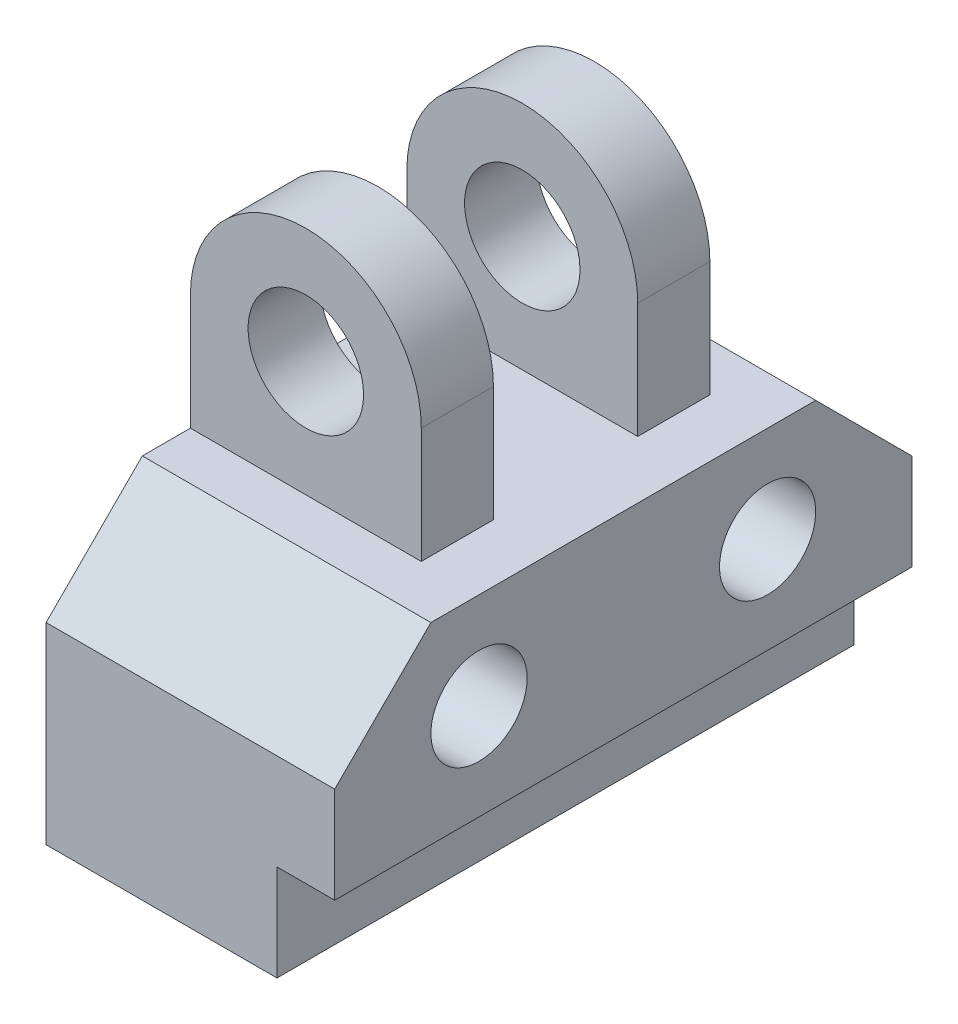
ISO-10303-21;
HEADER;
FILE_DESCRIPTION(('STEP AP214'),'2;1');
FILE_NAME('part.step','',(''),(''),'','','');
FILE_SCHEMA(('AUTOMOTIVE_DESIGN { 1 0 10303 214 1 1 1 1 }'));
ENDSEC;
DATA;
#1=APPLICATION_CONTEXT('core data for automotive mechanical design processes');
#2=APPLICATION_PROTOCOL_DEFINITION('international standard','automotive_design',2000,#1);
#3=PRODUCT_CONTEXT('',#1,'mechanical');
#4=PRODUCT('Part','Part','',(#3));
#5=PRODUCT_RELATED_PRODUCT_CATEGORY('part','',(#4));
#6=PRODUCT_DEFINITION_FORMATION('','',#4);
#7=PRODUCT_DEFINITION_CONTEXT('part definition',#1,'design');
#8=PRODUCT_DEFINITION('design','',#6,#7);
#9=PRODUCT_DEFINITION_SHAPE('','',#8);
#10=(LENGTH_UNIT() NAMED_UNIT(*) SI_UNIT(.MILLI.,.METRE.));
#11=(NAMED_UNIT(*) PLANE_ANGLE_UNIT() SI_UNIT($,.RADIAN.));
#12=(NAMED_UNIT(*) SI_UNIT($,.STERADIAN.) SOLID_ANGLE_UNIT());
#13=UNCERTAINTY_MEASURE_WITH_UNIT(LENGTH_MEASURE(1.E-05),#10,'distance_accuracy_value','');
#14=(GEOMETRIC_REPRESENTATION_CONTEXT(3) GLOBAL_UNCERTAINTY_ASSIGNED_CONTEXT((#13)) GLOBAL_UNIT_ASSIGNED_CONTEXT((#10,
#11,#12)) REPRESENTATION_CONTEXT('',''));
#15=CARTESIAN_POINT('',(0.,0.,0.));
#16=DIRECTION('',(0.,0.,1.));
#17=DIRECTION('',(1.,0.,0.));
#18=AXIS2_PLACEMENT_3D('',#15,#16,#17);
#19=CARTESIAN_POINT('',(12.,27.,-15.));
#20=DIRECTION('',(0.,0.,1.));
#21=DIRECTION('',(1.,0.,0.));
#22=AXIS2_PLACEMENT_3D('',#19,#20,#21);
#23=CYLINDRICAL_SURFACE('',#22,12.);
#24=DIRECTION('',(0.,0.,1.));
#25=VECTOR('',#24,1.);
#26=CARTESIAN_POINT('',(24.,27.,-7.5));
#27=LINE('',#26,#25);
#28=CARTESIAN_POINT('',(24.,27.,-15.));
#29=VERTEX_POINT('',#28);
#30=CARTESIAN_POINT('',(24.,27.,-7.5));
#31=VERTEX_POINT('',#30);
#32=EDGE_CURVE('E284',#29,#31,#27,.T.);
#33=ORIENTED_EDGE('',*,*,#32,.F.);
#34=CARTESIAN_POINT('',(12.,27.,-15.));
#35=DIRECTION('',(0.,0.,-1.));
#36=DIRECTION('',(-1.,0.,0.));
#37=AXIS2_PLACEMENT_3D('',#34,#35,#36);
#38=CIRCLE('',#37,12.);
#39=CARTESIAN_POINT('',(0.,27.,-15.));
#40=VERTEX_POINT('',#39);
#41=EDGE_CURVE('E43',#40,#29,#38,.T.);
#42=ORIENTED_EDGE('',*,*,#41,.F.);
#43=DIRECTION('',(0.,0.,-1.));
#44=VECTOR('',#43,1.);
#45=CARTESIAN_POINT('',(0.,27.,-15.));
#46=LINE('',#45,#44);
#47=CARTESIAN_POINT('',(0.,27.,-7.5));
#48=VERTEX_POINT('',#47);
#49=EDGE_CURVE('E289',#48,#40,#46,.T.);
#50=ORIENTED_EDGE('',*,*,#49,.F.);
#51=CARTESIAN_POINT('',(12.,27.,-7.5));
#52=DIRECTION('',(0.,0.,1.));
#53=DIRECTION('',(1.,0.,0.));
#54=AXIS2_PLACEMENT_3D('',#51,#52,#53);
#55=CIRCLE('',#54,12.);
#56=EDGE_CURVE('E11',#31,#48,#55,.T.);
#57=ORIENTED_EDGE('',*,*,#56,.F.);
#58=EDGE_LOOP('',(#33,#42,#50,#57));
#59=FACE_BOUND('',#58,.T.);
#60=ADVANCED_FACE('F35',(#59),#23,.T.);
#61=CARTESIAN_POINT('',(12.,27.,7.5));
#62=DIRECTION('',(0.,0.,-1.));
#63=DIRECTION('',(-1.,0.,0.));
#64=AXIS2_PLACEMENT_3D('',#61,#62,#63);
#65=CYLINDRICAL_SURFACE('',#64,12.);
#66=DIRECTION('',(0.,0.,1.));
#67=VECTOR('',#66,1.);
#68=CARTESIAN_POINT('',(24.,27.,7.5));
#69=LINE('',#68,#67);
#70=CARTESIAN_POINT('',(24.,27.,7.5));
#71=VERTEX_POINT('',#70);
#72=CARTESIAN_POINT('',(24.,27.,15.));
#73=VERTEX_POINT('',#72);
#74=EDGE_CURVE('E275',#71,#73,#69,.T.);
#75=ORIENTED_EDGE('',*,*,#74,.F.);
#76=CARTESIAN_POINT('',(12.,27.,7.5));
#77=DIRECTION('',(0.,0.,1.));
#78=DIRECTION('',(1.,0.,0.));
#79=AXIS2_PLACEMENT_3D('',#76,#77,#78);
#80=CIRCLE('',#79,12.);
#81=CARTESIAN_POINT('',(0.,27.,7.5));
#82=VERTEX_POINT('',#81);
#83=EDGE_CURVE('E280',#82,#71,#80,.F.);
#84=ORIENTED_EDGE('',*,*,#83,.F.);
#85=DIRECTION('',(0.,0.,1.));
#86=VECTOR('',#85,1.);
#87=CARTESIAN_POINT('',(0.,27.,7.5));
#88=LINE('',#87,#86);
#89=CARTESIAN_POINT('',(0.,27.,15.));
#90=VERTEX_POINT('',#89);
#91=EDGE_CURVE('E278',#90,#82,#88,.F.);
#92=ORIENTED_EDGE('',*,*,#91,.F.);
#93=CARTESIAN_POINT('',(12.,27.,15.));
#94=DIRECTION('',(0.,0.,-1.));
#95=DIRECTION('',(-1.,0.,0.));
#96=AXIS2_PLACEMENT_3D('',#93,#94,#95);
#97=CIRCLE('',#96,12.);
#98=EDGE_CURVE('E282',#73,#90,#97,.F.);
#99=ORIENTED_EDGE('',*,*,#98,.F.);
#100=EDGE_LOOP('',(#75,#84,#92,#99));
#101=FACE_BOUND('',#100,.T.);
#102=ADVANCED_FACE('F310',(#101),#65,.T.);
#103=CARTESIAN_POINT('',(30.,15.,20.));
#104=DIRECTION('',(0.,-1.,0.));
#105=DIRECTION('',(0.,0.,-1.));
#106=AXIS2_PLACEMENT_3D('',#103,#104,#105);
#107=PLANE('',#106);
#108=DIRECTION('',(0.,0.,1.));
#109=VECTOR('',#108,1.);
#110=CARTESIAN_POINT('',(24.,15.,-7.5));
#111=LINE('',#110,#109);
#112=CARTESIAN_POINT('',(24.,15.,-15.));
#113=VERTEX_POINT('',#112);
#114=CARTESIAN_POINT('',(24.,15.,-7.5));
#115=VERTEX_POINT('',#114);
#116=EDGE_CURVE('E170',#113,#115,#111,.T.);
#117=ORIENTED_EDGE('',*,*,#116,.T.);
#118=DIRECTION('',(-1.,0.,0.));
#119=VECTOR('',#118,1.);
#120=CARTESIAN_POINT('',(0.,15.,-7.5));
#121=LINE('',#120,#119);
#122=CARTESIAN_POINT('',(0.,15.,-7.5));
#123=VERTEX_POINT('',#122);
#124=EDGE_CURVE('E148',#115,#123,#121,.T.);
#125=ORIENTED_EDGE('',*,*,#124,.T.);
#126=DIRECTION('',(0.,0.,1.));
#127=VECTOR('',#126,1.);
#128=CARTESIAN_POINT('',(0.,15.,20.));
#129=LINE('',#128,#127);
#130=CARTESIAN_POINT('',(0.,15.,7.5));
#131=VERTEX_POINT('',#130);
#132=EDGE_CURVE('E154',#123,#131,#129,.T.);
#133=ORIENTED_EDGE('',*,*,#132,.T.);
#134=DIRECTION('',(-1.,0.,0.));
#135=VECTOR('',#134,1.);
#136=CARTESIAN_POINT('',(0.,15.,7.5));
#137=LINE('',#136,#135);
#138=CARTESIAN_POINT('',(24.,15.,7.5));
#139=VERTEX_POINT('',#138);
#140=EDGE_CURVE('E195',#139,#131,#137,.T.);
#141=ORIENTED_EDGE('',*,*,#140,.F.);
#142=DIRECTION('',(0.,0.,-1.));
#143=VECTOR('',#142,1.);
#144=CARTESIAN_POINT('',(24.,15.,7.5));
#145=LINE('',#144,#143);
#146=CARTESIAN_POINT('',(24.,15.,15.));
#147=VERTEX_POINT('',#146);
#148=EDGE_CURVE('E192',#147,#139,#145,.T.);
#149=ORIENTED_EDGE('',*,*,#148,.F.);
#150=DIRECTION('',(1.,0.,0.));
#151=VECTOR('',#150,1.);
#152=CARTESIAN_POINT('',(0.,15.,15.));
#153=LINE('',#152,#151);
#154=CARTESIAN_POINT('',(0.,15.,15.));
#155=VERTEX_POINT('',#154);
#156=EDGE_CURVE('E189',#155,#147,#153,.T.);
#157=ORIENTED_EDGE('',*,*,#156,.F.);
#158=CARTESIAN_POINT('',(0.,15.,20.));
#159=VERTEX_POINT('',#158);
#160=EDGE_CURVE('E164',#155,#159,#129,.T.);
#161=ORIENTED_EDGE('',*,*,#160,.T.);
#162=DIRECTION('',(-1.,0.,0.));
#163=VECTOR('',#162,1.);
#164=CARTESIAN_POINT('',(30.,15.,20.));
#165=LINE('',#164,#163);
#166=CARTESIAN_POINT('',(30.,15.,20.));
#167=VERTEX_POINT('',#166);
#168=EDGE_CURVE('E266',#167,#159,#165,.T.);
#169=ORIENTED_EDGE('',*,*,#168,.F.);
#170=DIRECTION('',(0.,0.,1.));
#171=VECTOR('',#170,1.);
#172=CARTESIAN_POINT('',(30.,15.,20.));
#173=LINE('',#172,#171);
#174=CARTESIAN_POINT('',(30.,15.,-20.));
#175=VERTEX_POINT('',#174);
#176=EDGE_CURVE('E240',#175,#167,#173,.T.);
#177=ORIENTED_EDGE('',*,*,#176,.F.);
#178=DIRECTION('',(-1.,0.,0.));
#179=VECTOR('',#178,1.);
#180=CARTESIAN_POINT('',(30.,15.,-20.));
#181=LINE('',#180,#179);
#182=CARTESIAN_POINT('',(0.,15.,-20.));
#183=VERTEX_POINT('',#182);
#184=EDGE_CURVE('E269',#175,#183,#181,.T.);
#185=ORIENTED_EDGE('',*,*,#184,.T.);
#186=CARTESIAN_POINT('',(0.,15.,-15.));
#187=VERTEX_POINT('',#186);
#188=EDGE_CURVE('E163',#183,#187,#129,.T.);
#189=ORIENTED_EDGE('',*,*,#188,.T.);
#190=DIRECTION('',(1.,0.,0.));
#191=VECTOR('',#190,1.);
#192=CARTESIAN_POINT('',(0.,15.,-15.));
#193=LINE('',#192,#191);
#194=EDGE_CURVE('E173',#187,#113,#193,.T.);
#195=ORIENTED_EDGE('',*,*,#194,.T.);
#196=EDGE_LOOP('',(#117,#125,#133,#141,#149,#157,#161,#169,#177,#185,#189,#195));
#197=FACE_BOUND('',#196,.T.);
#198=ADVANCED_FACE('F167',(#197),#107,.F.);
#199=CARTESIAN_POINT('',(30.,0.,0.));
#200=DIRECTION('',(1.,0.,0.));
#201=DIRECTION('',(0.,0.,-1.));
#202=AXIS2_PLACEMENT_3D('',#199,#200,#201);
#203=PLANE('',#202);
#204=DIRECTION('',(0.,0.,1.));
#205=VECTOR('',#204,1.);
#206=CARTESIAN_POINT('',(30.,-5.,-30.));
#207=LINE('',#206,#205);
#208=CARTESIAN_POINT('',(30.,-5.,-30.));
#209=VERTEX_POINT('',#208);
#210=CARTESIAN_POINT('',(30.,-5.,30.));
#211=VERTEX_POINT('',#210);
#212=EDGE_CURVE('E212',#209,#211,#207,.T.);
#213=ORIENTED_EDGE('',*,*,#212,.F.);
#214=DIRECTION('',(0.,1.,0.));
#215=VECTOR('',#214,1.);
#216=CARTESIAN_POINT('',(30.,5.,-30.));
#217=LINE('',#216,#215);
#218=CARTESIAN_POINT('',(30.,5.,-30.));
#219=VERTEX_POINT('',#218);
#220=EDGE_CURVE('E235',#209,#219,#217,.T.);
#221=ORIENTED_EDGE('',*,*,#220,.T.);
#222=DIRECTION('',(0.,0.707106781186547,0.707106781186548));
#223=VECTOR('',#222,1.);
#224=CARTESIAN_POINT('',(30.,15.,-20.));
#225=LINE('',#224,#223);
#226=EDGE_CURVE('E237',#219,#175,#225,.T.);
#227=ORIENTED_EDGE('',*,*,#226,.T.);
#228=ORIENTED_EDGE('',*,*,#176,.T.);
#229=DIRECTION('',(0.,-0.707106781186548,0.707106781186547));
#230=VECTOR('',#229,1.);
#231=CARTESIAN_POINT('',(30.,5.,30.));
#232=LINE('',#231,#230);
#233=CARTESIAN_POINT('',(30.,5.,30.));
#234=VERTEX_POINT('',#233);
#235=EDGE_CURVE('E242',#167,#234,#232,.T.);
#236=ORIENTED_EDGE('',*,*,#235,.T.);
#237=DIRECTION('',(0.,-1.,0.));
#238=VECTOR('',#237,1.);
#239=CARTESIAN_POINT('',(30.,5.,30.));
#240=LINE('',#239,#238);
#241=EDGE_CURVE('E244',#234,#211,#240,.T.);
#242=ORIENTED_EDGE('',*,*,#241,.T.);
#243=EDGE_LOOP('',(#213,#221,#227,#228,#236,#242));
#244=FACE_BOUND('',#243,.T.);
#245=CARTESIAN_POINT('',(30.,5.,15.));
#246=DIRECTION('',(1.,0.,0.));
#247=DIRECTION('',(0.,0.,-1.));
#248=AXIS2_PLACEMENT_3D('',#245,#246,#247);
#249=CIRCLE('',#248,5.);
#250=CARTESIAN_POINT('',(30.,5.,9.99999999999999));
#251=VERTEX_POINT('',#250);
#252=EDGE_CURVE('E229',#251,#251,#249,.T.);
#253=ORIENTED_EDGE('',*,*,#252,.F.);
#254=EDGE_LOOP('',(#253));
#255=FACE_BOUND('',#254,.T.);
#256=CARTESIAN_POINT('',(30.,5.,-15.));
#257=DIRECTION('',(1.,0.,0.));
#258=DIRECTION('',(0.,0.,1.));
#259=AXIS2_PLACEMENT_3D('',#256,#257,#258);
#260=CIRCLE('',#259,5.);
#261=CARTESIAN_POINT('',(30.,5.,-10.));
#262=VERTEX_POINT('',#261);
#263=EDGE_CURVE('E223',#262,#262,#260,.T.);
#264=ORIENTED_EDGE('',*,*,#263,.F.);
#265=EDGE_LOOP('',(#264));
#266=FACE_BOUND('',#265,.T.);
#267=ADVANCED_FACE('F318',(#244,#255,#266),#203,.T.);
#268=CARTESIAN_POINT('',(0.,0.,0.));
#269=DIRECTION('',(1.,0.,0.));
#270=DIRECTION('',(0.,0.,-1.));
#271=AXIS2_PLACEMENT_3D('',#268,#269,#270);
#272=PLANE('',#271);
#273=DIRECTION('',(0.,-1.,0.));
#274=VECTOR('',#273,1.);
#275=CARTESIAN_POINT('',(0.,39.,-7.5));
#276=LINE('',#275,#274);
#277=EDGE_CURVE('E144',#48,#123,#276,.T.);
#278=ORIENTED_EDGE('',*,*,#277,.F.);
#279=ORIENTED_EDGE('',*,*,#49,.T.);
#280=DIRECTION('',(0.,-1.,0.));
#281=VECTOR('',#280,1.);
#282=CARTESIAN_POINT('',(0.,39.,-15.));
#283=LINE('',#282,#281);
#284=EDGE_CURVE('E181',#40,#187,#283,.T.);
#285=ORIENTED_EDGE('',*,*,#284,.T.);
#286=ORIENTED_EDGE('',*,*,#188,.F.);
#287=DIRECTION('',(0.,0.707106781186547,0.707106781186548));
#288=VECTOR('',#287,1.);
#289=CARTESIAN_POINT('',(0.,15.,-20.));
#290=LINE('',#289,#288);
#291=CARTESIAN_POINT('',(0.,5.,-30.));
#292=VERTEX_POINT('',#291);
#293=EDGE_CURVE('E250',#292,#183,#290,.T.);
#294=ORIENTED_EDGE('',*,*,#293,.F.);
#295=DIRECTION('',(0.,1.,0.));
#296=VECTOR('',#295,1.);
#297=CARTESIAN_POINT('',(0.,5.,-30.));
#298=LINE('',#297,#296);
#299=CARTESIAN_POINT('',(0.,-15.,-30.));
#300=VERTEX_POINT('',#299);
#301=EDGE_CURVE('E232',#300,#292,#298,.T.);
#302=ORIENTED_EDGE('',*,*,#301,.F.);
#303=DIRECTION('',(0.,0.,-1.));
#304=VECTOR('',#303,1.);
#305=CARTESIAN_POINT('',(0.,-15.,30.));
#306=LINE('',#305,#304);
#307=CARTESIAN_POINT('',(0.,-15.,30.));
#308=VERTEX_POINT('',#307);
#309=EDGE_CURVE('E238',#308,#300,#306,.T.);
#310=ORIENTED_EDGE('',*,*,#309,.F.);
#311=DIRECTION('',(0.,-1.,0.));
#312=VECTOR('',#311,1.);
#313=CARTESIAN_POINT('',(0.,5.,30.));
#314=LINE('',#313,#312);
#315=CARTESIAN_POINT('',(0.,5.,30.));
#316=VERTEX_POINT('',#315);
#317=EDGE_CURVE('E255',#316,#308,#314,.T.);
#318=ORIENTED_EDGE('',*,*,#317,.F.);
#319=DIRECTION('',(0.,-0.707106781186548,0.707106781186547));
#320=VECTOR('',#319,1.);
#321=CARTESIAN_POINT('',(0.,5.,30.));
#322=LINE('',#321,#320);
#323=EDGE_CURVE('E253',#159,#316,#322,.T.);
#324=ORIENTED_EDGE('',*,*,#323,.F.);
#325=ORIENTED_EDGE('',*,*,#160,.F.);
#326=DIRECTION('',(0.,-1.,0.));
#327=VECTOR('',#326,1.);
#328=CARTESIAN_POINT('',(0.,39.,15.));
#329=LINE('',#328,#327);
#330=EDGE_CURVE('E202',#90,#155,#329,.T.);
#331=ORIENTED_EDGE('',*,*,#330,.F.);
#332=ORIENTED_EDGE('',*,*,#91,.T.);
#333=DIRECTION('',(0.,-1.,0.));
#334=VECTOR('',#333,1.);
#335=CARTESIAN_POINT('',(0.,39.,7.5));
#336=LINE('',#335,#334);
#337=EDGE_CURVE('E159',#82,#131,#336,.T.);
#338=ORIENTED_EDGE('',*,*,#337,.T.);
#339=ORIENTED_EDGE('',*,*,#132,.F.);
#340=EDGE_LOOP('',(#278,#279,#285,#286,#294,#302,#310,#318,#324,#325,#331,#332,#338,#339));
#341=FACE_BOUND('',#340,.T.);
#342=CARTESIAN_POINT('',(0.,5.,15.));
#343=DIRECTION('',(1.,0.,0.));
#344=DIRECTION('',(0.,0.,-1.));
#345=AXIS2_PLACEMENT_3D('',#342,#343,#344);
#346=CIRCLE('',#345,5.);
#347=CARTESIAN_POINT('',(0.,5.,9.99999999999999));
#348=VERTEX_POINT('',#347);
#349=EDGE_CURVE('E226',#348,#348,#346,.T.);
#350=ORIENTED_EDGE('',*,*,#349,.T.);
#351=EDGE_LOOP('',(#350));
#352=FACE_BOUND('',#351,.T.);
#353=CARTESIAN_POINT('',(0.,5.,-15.));
#354=DIRECTION('',(1.,0.,0.));
#355=DIRECTION('',(0.,0.,1.));
#356=AXIS2_PLACEMENT_3D('',#353,#354,#355);
#357=CIRCLE('',#356,5.);
#358=CARTESIAN_POINT('',(0.,5.,-10.));
#359=VERTEX_POINT('',#358);
#360=EDGE_CURVE('E219',#359,#359,#357,.T.);
#361=ORIENTED_EDGE('',*,*,#360,.T.);
#362=EDGE_LOOP('',(#361));
#363=FACE_BOUND('',#362,.T.);
#364=ADVANCED_FACE('F155',(#341,#352,#363),#272,.F.);
#365=CARTESIAN_POINT('',(30.,5.,-30.));
#366=DIRECTION('',(0.,0.,1.));
#367=DIRECTION('',(0.,-1.,0.));
#368=AXIS2_PLACEMENT_3D('',#365,#366,#367);
#369=PLANE('',#368);
#370=DIRECTION('',(-1.,0.,0.));
#371=VECTOR('',#370,1.);
#372=CARTESIAN_POINT('',(30.,-5.,-30.));
#373=LINE('',#372,#371);
#374=CARTESIAN_POINT('',(24.,-5.,-30.));
#375=VERTEX_POINT('',#374);
#376=EDGE_CURVE('E205',#209,#375,#373,.T.);
#377=ORIENTED_EDGE('',*,*,#376,.T.);
#378=DIRECTION('',(0.,-1.,0.));
#379=VECTOR('',#378,1.);
#380=CARTESIAN_POINT('',(24.,-5.,-30.));
#381=LINE('',#380,#379);
#382=CARTESIAN_POINT('',(24.,-15.,-30.));
#383=VERTEX_POINT('',#382);
#384=EDGE_CURVE('E208',#375,#383,#381,.T.);
#385=ORIENTED_EDGE('',*,*,#384,.T.);
#386=DIRECTION('',(-1.,0.,0.));
#387=VECTOR('',#386,1.);
#388=CARTESIAN_POINT('',(30.,-15.,-30.));
#389=LINE('',#388,#387);
#390=EDGE_CURVE('E247',#383,#300,#389,.T.);
#391=ORIENTED_EDGE('',*,*,#390,.T.);
#392=ORIENTED_EDGE('',*,*,#301,.T.);
#393=DIRECTION('',(-1.,0.,0.));
#394=VECTOR('',#393,1.);
#395=CARTESIAN_POINT('',(30.,5.,-30.));
#396=LINE('',#395,#394);
#397=EDGE_CURVE('E272',#219,#292,#396,.T.);
#398=ORIENTED_EDGE('',*,*,#397,.F.);
#399=ORIENTED_EDGE('',*,*,#220,.F.);
#400=EDGE_LOOP('',(#377,#385,#391,#392,#398,#399));
#401=FACE_BOUND('',#400,.T.);
#402=ADVANCED_FACE('F325',(#401),#369,.F.);
#403=CARTESIAN_POINT('',(30.,15.,-20.));
#404=DIRECTION('',(0.,-0.707106781186548,0.707106781186547));
#405=DIRECTION('',(0.,-0.707106781186547,-0.707106781186548));
#406=AXIS2_PLACEMENT_3D('',#403,#404,#405);
#407=PLANE('',#406);
#408=ORIENTED_EDGE('',*,*,#293,.T.);
#409=ORIENTED_EDGE('',*,*,#184,.F.);
#410=ORIENTED_EDGE('',*,*,#226,.F.);
#411=ORIENTED_EDGE('',*,*,#397,.T.);
#412=EDGE_LOOP('',(#408,#409,#410,#411));
#413=FACE_BOUND('',#412,.T.);
#414=ADVANCED_FACE('F328',(#413),#407,.F.);
#415=CARTESIAN_POINT('',(30.,5.,30.));
#416=DIRECTION('',(0.,-0.707106781186547,-0.707106781186548));
#417=DIRECTION('',(0.,0.707106781186548,-0.707106781186547));
#418=AXIS2_PLACEMENT_3D('',#415,#416,#417);
#419=PLANE('',#418);
#420=ORIENTED_EDGE('',*,*,#323,.T.);
#421=DIRECTION('',(-1.,0.,0.));
#422=VECTOR('',#421,1.);
#423=CARTESIAN_POINT('',(30.,5.,30.));
#424=LINE('',#423,#422);
#425=EDGE_CURVE('E263',#234,#316,#424,.T.);
#426=ORIENTED_EDGE('',*,*,#425,.F.);
#427=ORIENTED_EDGE('',*,*,#235,.F.);
#428=ORIENTED_EDGE('',*,*,#168,.T.);
#429=EDGE_LOOP('',(#420,#426,#427,#428));
#430=FACE_BOUND('',#429,.T.);
#431=ADVANCED_FACE('F331',(#430),#419,.F.);
#432=CARTESIAN_POINT('',(30.,5.,30.));
#433=DIRECTION('',(0.,0.,-1.));
#434=DIRECTION('',(-1.,0.,0.));
#435=AXIS2_PLACEMENT_3D('',#432,#433,#434);
#436=PLANE('',#435);
#437=DIRECTION('',(-1.,0.,0.));
#438=VECTOR('',#437,1.);
#439=CARTESIAN_POINT('',(30.,-15.,30.));
#440=LINE('',#439,#438);
#441=CARTESIAN_POINT('',(24.,-15.,30.));
#442=VERTEX_POINT('',#441);
#443=EDGE_CURVE('E261',#442,#308,#440,.T.);
#444=ORIENTED_EDGE('',*,*,#443,.F.);
#445=DIRECTION('',(0.,-1.,0.));
#446=VECTOR('',#445,1.);
#447=CARTESIAN_POINT('',(24.,-5.,30.));
#448=LINE('',#447,#446);
#449=CARTESIAN_POINT('',(24.,-5.,30.));
#450=VERTEX_POINT('',#449);
#451=EDGE_CURVE('E209',#450,#442,#448,.T.);
#452=ORIENTED_EDGE('',*,*,#451,.F.);
#453=DIRECTION('',(-1.,0.,0.));
#454=VECTOR('',#453,1.);
#455=CARTESIAN_POINT('',(30.,-5.,30.));
#456=LINE('',#455,#454);
#457=EDGE_CURVE('E204',#211,#450,#456,.T.);
#458=ORIENTED_EDGE('',*,*,#457,.F.);
#459=ORIENTED_EDGE('',*,*,#241,.F.);
#460=ORIENTED_EDGE('',*,*,#425,.T.);
#461=ORIENTED_EDGE('',*,*,#317,.T.);
#462=EDGE_LOOP('',(#444,#452,#458,#459,#460,#461));
#463=FACE_BOUND('',#462,.T.);
#464=ADVANCED_FACE('F336',(#463),#436,.F.);
#465=CARTESIAN_POINT('',(30.,-15.,30.));
#466=DIRECTION('',(0.,1.,0.));
#467=DIRECTION('',(0.,0.,1.));
#468=AXIS2_PLACEMENT_3D('',#465,#466,#467);
#469=PLANE('',#468);
#470=ORIENTED_EDGE('',*,*,#390,.F.);
#471=DIRECTION('',(0.,0.,1.));
#472=VECTOR('',#471,1.);
#473=CARTESIAN_POINT('',(24.,-15.,-30.));
#474=LINE('',#473,#472);
#475=EDGE_CURVE('E216',#383,#442,#474,.T.);
#476=ORIENTED_EDGE('',*,*,#475,.T.);
#477=ORIENTED_EDGE('',*,*,#443,.T.);
#478=ORIENTED_EDGE('',*,*,#309,.T.);
#479=EDGE_LOOP('',(#470,#476,#477,#478));
#480=FACE_BOUND('',#479,.T.);
#481=ADVANCED_FACE('F340',(#480),#469,.F.);
#482=CARTESIAN_POINT('',(30.,5.,15.));
#483=DIRECTION('',(-1.,0.,0.));
#484=DIRECTION('',(0.,0.,1.));
#485=AXIS2_PLACEMENT_3D('',#482,#483,#484);
#486=CYLINDRICAL_SURFACE('',#485,5.);
#487=ORIENTED_EDGE('',*,*,#252,.T.);
#488=EDGE_LOOP('',(#487));
#489=FACE_BOUND('',#488,.T.);
#490=ORIENTED_EDGE('',*,*,#349,.F.);
#491=EDGE_LOOP('',(#490));
#492=FACE_BOUND('',#491,.T.);
#493=ADVANCED_FACE('F344',(#489,#492),#486,.F.);
#494=CARTESIAN_POINT('',(30.,5.,-15.));
#495=DIRECTION('',(-1.,0.,0.));
#496=DIRECTION('',(0.,0.,1.));
#497=AXIS2_PLACEMENT_3D('',#494,#495,#496);
#498=CYLINDRICAL_SURFACE('',#497,5.);
#499=ORIENTED_EDGE('',*,*,#263,.T.);
#500=EDGE_LOOP('',(#499));
#501=FACE_BOUND('',#500,.T.);
#502=ORIENTED_EDGE('',*,*,#360,.F.);
#503=EDGE_LOOP('',(#502));
#504=FACE_BOUND('',#503,.T.);
#505=ADVANCED_FACE('F353',(#501,#504),#498,.F.);
#506=CARTESIAN_POINT('',(24.,-5.,-30.));
#507=DIRECTION('',(-1.,0.,0.));
#508=DIRECTION('',(0.,0.,1.));
#509=AXIS2_PLACEMENT_3D('',#506,#507,#508);
#510=PLANE('',#509);
#511=ORIENTED_EDGE('',*,*,#451,.T.);
#512=ORIENTED_EDGE('',*,*,#475,.F.);
#513=ORIENTED_EDGE('',*,*,#384,.F.);
#514=DIRECTION('',(0.,0.,1.));
#515=VECTOR('',#514,1.);
#516=CARTESIAN_POINT('',(24.,-5.,-30.));
#517=LINE('',#516,#515);
#518=EDGE_CURVE('E220',#375,#450,#517,.T.);
#519=ORIENTED_EDGE('',*,*,#518,.T.);
#520=EDGE_LOOP('',(#511,#512,#513,#519));
#521=FACE_BOUND('',#520,.T.);
#522=ADVANCED_FACE('F357',(#521),#510,.F.);
#523=CARTESIAN_POINT('',(30.,-5.,-30.));
#524=DIRECTION('',(0.,1.,0.));
#525=DIRECTION('',(0.,0.,1.));
#526=AXIS2_PLACEMENT_3D('',#523,#524,#525);
#527=PLANE('',#526);
#528=ORIENTED_EDGE('',*,*,#457,.T.);
#529=ORIENTED_EDGE('',*,*,#518,.F.);
#530=ORIENTED_EDGE('',*,*,#376,.F.);
#531=ORIENTED_EDGE('',*,*,#212,.T.);
#532=EDGE_LOOP('',(#528,#529,#530,#531));
#533=FACE_BOUND('',#532,.T.);
#534=ADVANCED_FACE('F359',(#533),#527,.F.);
#535=CARTESIAN_POINT('',(0.,39.,15.));
#536=DIRECTION('',(0.,0.,-1.));
#537=DIRECTION('',(-1.,0.,0.));
#538=AXIS2_PLACEMENT_3D('',#535,#536,#537);
#539=PLANE('',#538);
#540=CARTESIAN_POINT('',(12.,27.,15.));
#541=DIRECTION('',(0.,0.,1.));
#542=DIRECTION('',(1.,0.,0.));
#543=AXIS2_PLACEMENT_3D('',#540,#541,#542);
#544=CIRCLE('',#543,6.);
#545=CARTESIAN_POINT('',(18.,27.,15.));
#546=VERTEX_POINT('',#545);
#547=EDGE_CURVE('E150',#546,#546,#544,.T.);
#548=ORIENTED_EDGE('',*,*,#547,.F.);
#549=EDGE_LOOP('',(#548));
#550=FACE_BOUND('',#549,.T.);
#551=DIRECTION('',(0.,-1.,0.));
#552=VECTOR('',#551,1.);
#553=CARTESIAN_POINT('',(24.,39.,15.));
#554=LINE('',#553,#552);
#555=EDGE_CURVE('E200',#73,#147,#554,.T.);
#556=ORIENTED_EDGE('',*,*,#555,.F.);
#557=ORIENTED_EDGE('',*,*,#98,.T.);
#558=ORIENTED_EDGE('',*,*,#330,.T.);
#559=ORIENTED_EDGE('',*,*,#156,.T.);
#560=EDGE_LOOP('',(#556,#557,#558,#559));
#561=FACE_BOUND('',#560,.T.);
#562=ADVANCED_FACE('F362',(#550,#561),#539,.F.);
#563=CARTESIAN_POINT('',(24.,39.,7.5));
#564=DIRECTION('',(-1.,0.,0.));
#565=DIRECTION('',(0.,0.,1.));
#566=AXIS2_PLACEMENT_3D('',#563,#564,#565);
#567=PLANE('',#566);
#568=DIRECTION('',(0.,-1.,0.));
#569=VECTOR('',#568,1.);
#570=CARTESIAN_POINT('',(24.,39.,7.5));
#571=LINE('',#570,#569);
#572=EDGE_CURVE('E198',#71,#139,#571,.T.);
#573=ORIENTED_EDGE('',*,*,#572,.F.);
#574=ORIENTED_EDGE('',*,*,#74,.T.);
#575=ORIENTED_EDGE('',*,*,#555,.T.);
#576=ORIENTED_EDGE('',*,*,#148,.T.);
#577=EDGE_LOOP('',(#573,#574,#575,#576));
#578=FACE_BOUND('',#577,.T.);
#579=ADVANCED_FACE('F369',(#578),#567,.F.);
#580=CARTESIAN_POINT('',(0.,39.,7.5));
#581=DIRECTION('',(0.,0.,1.));
#582=DIRECTION('',(1.,0.,0.));
#583=AXIS2_PLACEMENT_3D('',#580,#581,#582);
#584=PLANE('',#583);
#585=CARTESIAN_POINT('',(12.,27.,7.5));
#586=DIRECTION('',(0.,0.,1.));
#587=DIRECTION('',(1.,0.,0.));
#588=AXIS2_PLACEMENT_3D('',#585,#586,#587);
#589=CIRCLE('',#588,6.);
#590=CARTESIAN_POINT('',(18.,27.,7.5));
#591=VERTEX_POINT('',#590);
#592=EDGE_CURVE('E188',#591,#591,#589,.T.);
#593=ORIENTED_EDGE('',*,*,#592,.T.);
#594=EDGE_LOOP('',(#593));
#595=FACE_BOUND('',#594,.T.);
#596=ORIENTED_EDGE('',*,*,#337,.F.);
#597=ORIENTED_EDGE('',*,*,#83,.T.);
#598=ORIENTED_EDGE('',*,*,#572,.T.);
#599=ORIENTED_EDGE('',*,*,#140,.T.);
#600=EDGE_LOOP('',(#596,#597,#598,#599));
#601=FACE_BOUND('',#600,.T.);
#602=ADVANCED_FACE('F373',(#595,#601),#584,.F.);
#603=CARTESIAN_POINT('',(12.,27.,-7.00000000000001));
#604=DIRECTION('',(0.,0.,1.));
#605=DIRECTION('',(1.,0.,0.));
#606=AXIS2_PLACEMENT_3D('',#603,#604,#605);
#607=CYLINDRICAL_SURFACE('',#606,6.);
#608=ORIENTED_EDGE('',*,*,#547,.T.);
#609=EDGE_LOOP('',(#608));
#610=FACE_BOUND('',#609,.T.);
#611=ORIENTED_EDGE('',*,*,#592,.F.);
#612=EDGE_LOOP('',(#611));
#613=FACE_BOUND('',#612,.T.);
#614=ADVANCED_FACE('F306',(#610,#613),#607,.F.);
#615=CARTESIAN_POINT('',(0.,39.,-7.5));
#616=DIRECTION('',(0.,0.,1.));
#617=DIRECTION('',(1.,0.,0.));
#618=AXIS2_PLACEMENT_3D('',#615,#616,#617);
#619=PLANE('',#618);
#620=CARTESIAN_POINT('',(12.,27.,-7.5));
#621=DIRECTION('',(0.,0.,1.));
#622=DIRECTION('',(1.,0.,0.));
#623=AXIS2_PLACEMENT_3D('',#620,#621,#622);
#624=CIRCLE('',#623,6.);
#625=CARTESIAN_POINT('',(18.,27.,-7.5));
#626=VERTEX_POINT('',#625);
#627=EDGE_CURVE('E171',#626,#626,#624,.F.);
#628=ORIENTED_EDGE('',*,*,#627,.T.);
#629=EDGE_LOOP('',(#628));
#630=FACE_BOUND('',#629,.T.);
#631=DIRECTION('',(0.,-1.,0.));
#632=VECTOR('',#631,1.);
#633=CARTESIAN_POINT('',(24.,39.,-7.5));
#634=LINE('',#633,#632);
#635=EDGE_CURVE('E151',#31,#115,#634,.T.);
#636=ORIENTED_EDGE('',*,*,#635,.F.);
#637=ORIENTED_EDGE('',*,*,#56,.T.);
#638=ORIENTED_EDGE('',*,*,#277,.T.);
#639=ORIENTED_EDGE('',*,*,#124,.F.);
#640=EDGE_LOOP('',(#636,#637,#638,#639));
#641=FACE_BOUND('',#640,.T.);
#642=ADVANCED_FACE('F146',(#630,#641),#619,.T.);
#643=CARTESIAN_POINT('',(24.,39.,-7.5));
#644=DIRECTION('',(1.,0.,0.));
#645=DIRECTION('',(0.,0.,-1.));
#646=AXIS2_PLACEMENT_3D('',#643,#644,#645);
#647=PLANE('',#646);
#648=DIRECTION('',(0.,-1.,0.));
#649=VECTOR('',#648,1.);
#650=CARTESIAN_POINT('',(24.,39.,-15.));
#651=LINE('',#650,#649);
#652=EDGE_CURVE('E183',#29,#113,#651,.T.);
#653=ORIENTED_EDGE('',*,*,#652,.F.);
#654=ORIENTED_EDGE('',*,*,#32,.T.);
#655=ORIENTED_EDGE('',*,*,#635,.T.);
#656=ORIENTED_EDGE('',*,*,#116,.F.);
#657=EDGE_LOOP('',(#653,#654,#655,#656));
#658=FACE_BOUND('',#657,.T.);
#659=ADVANCED_FACE('F296',(#658),#647,.T.);
#660=CARTESIAN_POINT('',(0.,39.,-15.));
#661=DIRECTION('',(0.,0.,-1.));
#662=DIRECTION('',(-1.,0.,0.));
#663=AXIS2_PLACEMENT_3D('',#660,#661,#662);
#664=PLANE('',#663);
#665=CARTESIAN_POINT('',(12.,27.,-15.));
#666=DIRECTION('',(0.,0.,1.));
#667=DIRECTION('',(1.,0.,0.));
#668=AXIS2_PLACEMENT_3D('',#665,#666,#667);
#669=CIRCLE('',#668,6.);
#670=CARTESIAN_POINT('',(18.,27.,-15.));
#671=VERTEX_POINT('',#670);
#672=EDGE_CURVE('E176',#671,#671,#669,.T.);
#673=ORIENTED_EDGE('',*,*,#672,.T.);
#674=EDGE_LOOP('',(#673));
#675=FACE_BOUND('',#674,.T.);
#676=ORIENTED_EDGE('',*,*,#284,.F.);
#677=ORIENTED_EDGE('',*,*,#41,.T.);
#678=ORIENTED_EDGE('',*,*,#652,.T.);
#679=ORIENTED_EDGE('',*,*,#194,.F.);
#680=EDGE_LOOP('',(#676,#677,#678,#679));
#681=FACE_BOUND('',#680,.T.);
#682=ADVANCED_FACE('F292',(#675,#681),#664,.T.);
#683=CARTESIAN_POINT('',(12.,27.,7.00000000000001));
#684=DIRECTION('',(0.,0.,-1.));
#685=DIRECTION('',(-1.,0.,0.));
#686=AXIS2_PLACEMENT_3D('',#683,#684,#685);
#687=CYLINDRICAL_SURFACE('',#686,6.);
#688=ORIENTED_EDGE('',*,*,#627,.F.);
#689=EDGE_LOOP('',(#688));
#690=FACE_BOUND('',#689,.T.);
#691=ORIENTED_EDGE('',*,*,#672,.F.);
#692=EDGE_LOOP('',(#691));
#693=FACE_BOUND('',#692,.T.);
#694=ADVANCED_FACE('F303',(#690,#693),#687,.F.);
#695=CLOSED_SHELL('',(#60,#102,#198,#267,#364,#402,#414,#431,#464,#481,#493,#505,#522,#534,#562,
#579,#602,#614,#642,#659,#682,#694));
#696=MANIFOLD_SOLID_BREP('B2',#695);
#697=ADVANCED_BREP_SHAPE_REPRESENTATION('',(#18,#696),#14);
#698=SHAPE_DEFINITION_REPRESENTATION(#9,#697);
ENDSEC;
END-ISO-10303-21;
